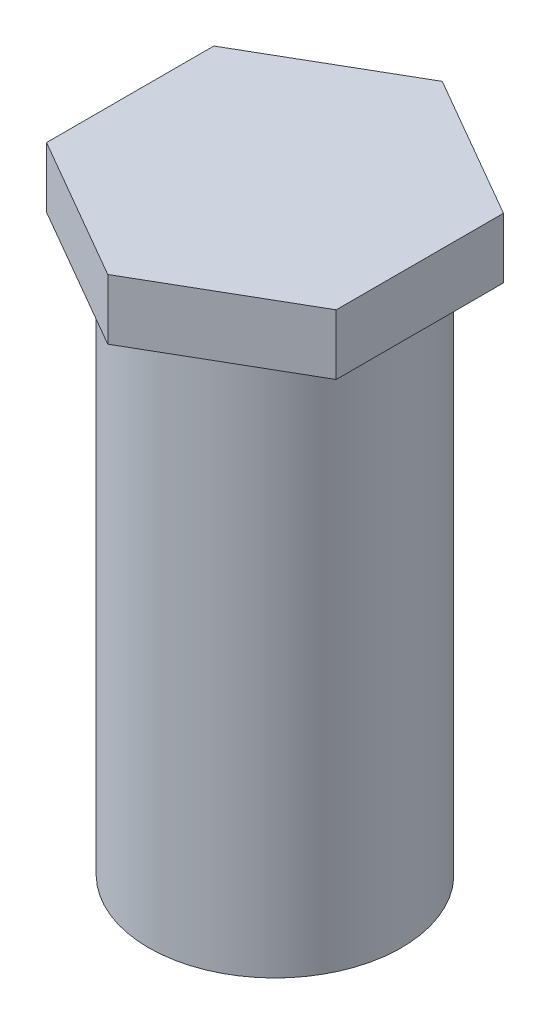
ISO-10303-21;
HEADER;
FILE_DESCRIPTION(('STEP AP214'),'2;1');
FILE_NAME('part.step','',(''),(''),'','','');
FILE_SCHEMA(('AUTOMOTIVE_DESIGN { 1 0 10303 214 1 1 1 1 }'));
ENDSEC;
DATA;
#1=APPLICATION_CONTEXT('core data for automotive mechanical design processes');
#2=APPLICATION_PROTOCOL_DEFINITION('international standard','automotive_design',2000,#1);
#3=PRODUCT_CONTEXT('',#1,'mechanical');
#4=PRODUCT('Part','Part','',(#3));
#5=PRODUCT_RELATED_PRODUCT_CATEGORY('part','',(#4));
#6=PRODUCT_DEFINITION_FORMATION('','',#4);
#7=PRODUCT_DEFINITION_CONTEXT('part definition',#1,'design');
#8=PRODUCT_DEFINITION('design','',#6,#7);
#9=PRODUCT_DEFINITION_SHAPE('','',#8);
#10=(LENGTH_UNIT() NAMED_UNIT(*) SI_UNIT(.MILLI.,.METRE.));
#11=(NAMED_UNIT(*) PLANE_ANGLE_UNIT() SI_UNIT($,.RADIAN.));
#12=(NAMED_UNIT(*) SI_UNIT($,.STERADIAN.) SOLID_ANGLE_UNIT());
#13=UNCERTAINTY_MEASURE_WITH_UNIT(LENGTH_MEASURE(1.E-05),#10,'distance_accuracy_value','');
#14=(GEOMETRIC_REPRESENTATION_CONTEXT(3) GLOBAL_UNCERTAINTY_ASSIGNED_CONTEXT((#13)) GLOBAL_UNIT_ASSIGNED_CONTEXT((#10,
#11,#12)) REPRESENTATION_CONTEXT('',''));
#15=CARTESIAN_POINT('',(0.,0.,0.));
#16=DIRECTION('',(0.,0.,1.));
#17=DIRECTION('',(1.,0.,0.));
#18=AXIS2_PLACEMENT_3D('',#15,#16,#17);
#19=CARTESIAN_POINT('',(0.,0.,0.));
#20=DIRECTION('',(0.,1.,0.));
#21=DIRECTION('',(0.,0.,1.));
#22=AXIS2_PLACEMENT_3D('',#19,#20,#21);
#23=CYLINDRICAL_SURFACE('',#22,2.095);
#24=CARTESIAN_POINT('',(0.,-10.,0.));
#25=DIRECTION('',(0.,1.,0.));
#26=DIRECTION('',(0.,0.,1.));
#27=AXIS2_PLACEMENT_3D('',#24,#25,#26);
#28=CIRCLE('',#27,2.095);
#29=CARTESIAN_POINT('',(0.,-10.,2.095));
#30=VERTEX_POINT('',#29);
#31=EDGE_CURVE('E45',#30,#30,#28,.T.);
#32=ORIENTED_EDGE('',*,*,#31,.T.);
#33=EDGE_LOOP('',(#32));
#34=FACE_BOUND('',#33,.T.);
#35=CARTESIAN_POINT('',(0.,-1.,0.));
#36=DIRECTION('',(0.,1.,0.));
#37=DIRECTION('',(0.,0.,1.));
#38=AXIS2_PLACEMENT_3D('',#35,#36,#37);
#39=CIRCLE('',#38,2.095);
#40=CARTESIAN_POINT('',(0.,-1.,2.095));
#41=VERTEX_POINT('',#40);
#42=EDGE_CURVE('E11',#41,#41,#39,.T.);
#43=ORIENTED_EDGE('',*,*,#42,.F.);
#44=EDGE_LOOP('',(#43));
#45=FACE_BOUND('',#44,.T.);
#46=ADVANCED_FACE('F36',(#34,#45),#23,.T.);
#47=CARTESIAN_POINT('',(2.095,-10.,0.));
#48=DIRECTION('',(0.,1.,0.));
#49=DIRECTION('',(0.,0.,1.));
#50=AXIS2_PLACEMENT_3D('',#47,#48,#49);
#51=PLANE('',#50);
#52=CARTESIAN_POINT('',(0.,-10.,0.));
#53=DIRECTION('',(0.,-1.,0.));
#54=DIRECTION('',(0.,0.,-1.));
#55=AXIS2_PLACEMENT_3D('',#52,#53,#54);
#56=CIRCLE('',#55,1.24999999999999);
#57=CARTESIAN_POINT('',(0.,-10.,-1.24999999999999));
#58=VERTEX_POINT('',#57);
#59=EDGE_CURVE('E195',#58,#58,#56,.T.);
#60=ORIENTED_EDGE('',*,*,#59,.F.);
#61=EDGE_LOOP('',(#60));
#62=FACE_BOUND('',#61,.T.);
#63=ORIENTED_EDGE('',*,*,#31,.F.);
#64=EDGE_LOOP('',(#63));
#65=FACE_BOUND('',#64,.T.);
#66=ADVANCED_FACE('F154',(#62,#65),#51,.F.);
#67=CARTESIAN_POINT('',(0.,-1.,0.));
#68=DIRECTION('',(0.,1.,0.));
#69=DIRECTION('',(0.,0.,1.));
#70=AXIS2_PLACEMENT_3D('',#67,#68,#69);
#71=PLANE('',#70);
#72=DIRECTION('',(0.866025403784439,0.,-0.5));
#73=VECTOR('',#72,1.);
#74=CARTESIAN_POINT('',(0.,-1.,2.7712812921102));
#75=LINE('',#74,#73);
#76=CARTESIAN_POINT('',(0.,-1.,2.7712812921102));
#77=VERTEX_POINT('',#76);
#78=CARTESIAN_POINT('',(2.4,-1.,1.3856406460551));
#79=VERTEX_POINT('',#78);
#80=EDGE_CURVE('E143',#77,#79,#75,.T.);
#81=ORIENTED_EDGE('',*,*,#80,.F.);
#82=DIRECTION('',(0.866025403784439,0.,0.5));
#83=VECTOR('',#82,1.);
#84=CARTESIAN_POINT('',(-2.4,-1.,1.3856406460551));
#85=LINE('',#84,#83);
#86=CARTESIAN_POINT('',(-2.4,-1.,1.3856406460551));
#87=VERTEX_POINT('',#86);
#88=EDGE_CURVE('E117',#87,#77,#85,.T.);
#89=ORIENTED_EDGE('',*,*,#88,.F.);
#90=DIRECTION('',(0.,0.,1.));
#91=VECTOR('',#90,1.);
#92=CARTESIAN_POINT('',(-2.4,-1.,-1.3856406460551));
#93=LINE('',#92,#91);
#94=CARTESIAN_POINT('',(-2.4,-1.,-1.3856406460551));
#95=VERTEX_POINT('',#94);
#96=EDGE_CURVE('E101',#95,#87,#93,.T.);
#97=ORIENTED_EDGE('',*,*,#96,.F.);
#98=DIRECTION('',(-0.866025403784439,0.,0.5));
#99=VECTOR('',#98,1.);
#100=CARTESIAN_POINT('',(0.,-1.,-2.77128129211021));
#101=LINE('',#100,#99);
#102=CARTESIAN_POINT('',(0.,-1.,-2.77128129211021));
#103=VERTEX_POINT('',#102);
#104=EDGE_CURVE('E115',#103,#95,#101,.T.);
#105=ORIENTED_EDGE('',*,*,#104,.F.);
#106=DIRECTION('',(-0.866025403784439,0.,-0.5));
#107=VECTOR('',#106,1.);
#108=CARTESIAN_POINT('',(2.4,-1.,-1.3856406460551));
#109=LINE('',#108,#107);
#110=CARTESIAN_POINT('',(2.4,-1.,-1.3856406460551));
#111=VERTEX_POINT('',#110);
#112=EDGE_CURVE('E120',#111,#103,#109,.T.);
#113=ORIENTED_EDGE('',*,*,#112,.F.);
#114=DIRECTION('',(0.,0.,-1.));
#115=VECTOR('',#114,1.);
#116=CARTESIAN_POINT('',(2.4,-1.,1.3856406460551));
#117=LINE('',#116,#115);
#118=EDGE_CURVE('E122',#79,#111,#117,.T.);
#119=ORIENTED_EDGE('',*,*,#118,.F.);
#120=EDGE_LOOP('',(#81,#89,#97,#105,#113,#119));
#121=FACE_BOUND('',#120,.T.);
#122=ORIENTED_EDGE('',*,*,#42,.T.);
#123=EDGE_LOOP('',(#122));
#124=FACE_BOUND('',#123,.T.);
#125=ADVANCED_FACE('F112',(#121,#124),#71,.F.);
#126=CARTESIAN_POINT('',(0.,-1.,2.7712812921102));
#127=DIRECTION('',(0.5,0.,0.866025403784439));
#128=DIRECTION('',(0.866025403784439,0.,-0.5));
#129=AXIS2_PLACEMENT_3D('',#126,#127,#128);
#130=PLANE('',#129);
#131=DIRECTION('',(0.866025403784439,0.,-0.5));
#132=VECTOR('',#131,1.);
#133=CARTESIAN_POINT('',(0.,0.,2.7712812921102));
#134=LINE('',#133,#132);
#135=CARTESIAN_POINT('',(0.,0.,2.7712812921102));
#136=VERTEX_POINT('',#135);
#137=CARTESIAN_POINT('',(2.4,0.,1.3856406460551));
#138=VERTEX_POINT('',#137);
#139=EDGE_CURVE('E127',#136,#138,#134,.T.);
#140=ORIENTED_EDGE('',*,*,#139,.F.);
#141=DIRECTION('',(0.,1.,0.));
#142=VECTOR('',#141,1.);
#143=CARTESIAN_POINT('',(0.,-1.,2.7712812921102));
#144=LINE('',#143,#142);
#145=EDGE_CURVE('E53',#77,#136,#144,.T.);
#146=ORIENTED_EDGE('',*,*,#145,.F.);
#147=ORIENTED_EDGE('',*,*,#80,.T.);
#148=DIRECTION('',(0.,1.,0.));
#149=VECTOR('',#148,1.);
#150=CARTESIAN_POINT('',(2.4,-1.,1.3856406460551));
#151=LINE('',#150,#149);
#152=EDGE_CURVE('E89',#79,#138,#151,.T.);
#153=ORIENTED_EDGE('',*,*,#152,.T.);
#154=EDGE_LOOP('',(#140,#146,#147,#153));
#155=FACE_BOUND('',#154,.T.);
#156=ADVANCED_FACE('F162',(#155),#130,.T.);
#157=CARTESIAN_POINT('',(-2.4,-1.,1.3856406460551));
#158=DIRECTION('',(-0.5,0.,0.866025403784439));
#159=DIRECTION('',(0.866025403784439,0.,0.5));
#160=AXIS2_PLACEMENT_3D('',#157,#158,#159);
#161=PLANE('',#160);
#162=DIRECTION('',(0.866025403784439,0.,0.5));
#163=VECTOR('',#162,1.);
#164=CARTESIAN_POINT('',(-2.4,0.,1.3856406460551));
#165=LINE('',#164,#163);
#166=CARTESIAN_POINT('',(-2.4,0.,1.3856406460551));
#167=VERTEX_POINT('',#166);
#168=EDGE_CURVE('E140',#167,#136,#165,.T.);
#169=ORIENTED_EDGE('',*,*,#168,.F.);
#170=DIRECTION('',(0.,1.,0.));
#171=VECTOR('',#170,1.);
#172=CARTESIAN_POINT('',(-2.4,-1.,1.3856406460551));
#173=LINE('',#172,#171);
#174=EDGE_CURVE('E77',#87,#167,#173,.T.);
#175=ORIENTED_EDGE('',*,*,#174,.F.);
#176=ORIENTED_EDGE('',*,*,#88,.T.);
#177=ORIENTED_EDGE('',*,*,#145,.T.);
#178=EDGE_LOOP('',(#169,#175,#176,#177));
#179=FACE_BOUND('',#178,.T.);
#180=ADVANCED_FACE('F168',(#179),#161,.T.);
#181=CARTESIAN_POINT('',(-2.4,-1.,-1.3856406460551));
#182=DIRECTION('',(-1.,0.,0.));
#183=DIRECTION('',(0.,0.,1.));
#184=AXIS2_PLACEMENT_3D('',#181,#182,#183);
#185=PLANE('',#184);
#186=DIRECTION('',(0.,0.,1.));
#187=VECTOR('',#186,1.);
#188=CARTESIAN_POINT('',(-2.4,0.,-1.3856406460551));
#189=LINE('',#188,#187);
#190=CARTESIAN_POINT('',(-2.4,0.,-1.3856406460551));
#191=VERTEX_POINT('',#190);
#192=EDGE_CURVE('E103',#191,#167,#189,.T.);
#193=ORIENTED_EDGE('',*,*,#192,.F.);
#194=DIRECTION('',(0.,1.,0.));
#195=VECTOR('',#194,1.);
#196=CARTESIAN_POINT('',(-2.4,-1.,-1.3856406460551));
#197=LINE('',#196,#195);
#198=EDGE_CURVE('E98',#95,#191,#197,.T.);
#199=ORIENTED_EDGE('',*,*,#198,.F.);
#200=ORIENTED_EDGE('',*,*,#96,.T.);
#201=ORIENTED_EDGE('',*,*,#174,.T.);
#202=EDGE_LOOP('',(#193,#199,#200,#201));
#203=FACE_BOUND('',#202,.T.);
#204=ADVANCED_FACE('F100',(#203),#185,.T.);
#205=CARTESIAN_POINT('',(0.,-1.,-2.77128129211021));
#206=DIRECTION('',(-0.5,0.,-0.866025403784439));
#207=DIRECTION('',(-0.866025403784439,0.,0.5));
#208=AXIS2_PLACEMENT_3D('',#205,#206,#207);
#209=PLANE('',#208);
#210=DIRECTION('',(-0.866025403784439,0.,0.5));
#211=VECTOR('',#210,1.);
#212=CARTESIAN_POINT('',(0.,0.,-2.77128129211021));
#213=LINE('',#212,#211);
#214=CARTESIAN_POINT('',(0.,0.,-2.77128129211021));
#215=VERTEX_POINT('',#214);
#216=EDGE_CURVE('E137',#215,#191,#213,.T.);
#217=ORIENTED_EDGE('',*,*,#216,.F.);
#218=DIRECTION('',(0.,1.,0.));
#219=VECTOR('',#218,1.);
#220=CARTESIAN_POINT('',(0.,-1.,-2.77128129211021));
#221=LINE('',#220,#219);
#222=EDGE_CURVE('E108',#103,#215,#221,.T.);
#223=ORIENTED_EDGE('',*,*,#222,.F.);
#224=ORIENTED_EDGE('',*,*,#104,.T.);
#225=ORIENTED_EDGE('',*,*,#198,.T.);
#226=EDGE_LOOP('',(#217,#223,#224,#225));
#227=FACE_BOUND('',#226,.T.);
#228=ADVANCED_FACE('F119',(#227),#209,.T.);
#229=CARTESIAN_POINT('',(2.4,-1.,-1.3856406460551));
#230=DIRECTION('',(0.5,0.,-0.866025403784439));
#231=DIRECTION('',(-0.866025403784439,0.,-0.5));
#232=AXIS2_PLACEMENT_3D('',#229,#230,#231);
#233=PLANE('',#232);
#234=DIRECTION('',(-0.866025403784439,0.,-0.5));
#235=VECTOR('',#234,1.);
#236=CARTESIAN_POINT('',(2.4,0.,-1.3856406460551));
#237=LINE('',#236,#235);
#238=CARTESIAN_POINT('',(2.4,0.,-1.3856406460551));
#239=VERTEX_POINT('',#238);
#240=EDGE_CURVE('E134',#239,#215,#237,.T.);
#241=ORIENTED_EDGE('',*,*,#240,.F.);
#242=DIRECTION('',(0.,1.,0.));
#243=VECTOR('',#242,1.);
#244=CARTESIAN_POINT('',(2.4,-1.,-1.3856406460551));
#245=LINE('',#244,#243);
#246=EDGE_CURVE('E147',#111,#239,#245,.T.);
#247=ORIENTED_EDGE('',*,*,#246,.F.);
#248=ORIENTED_EDGE('',*,*,#112,.T.);
#249=ORIENTED_EDGE('',*,*,#222,.T.);
#250=EDGE_LOOP('',(#241,#247,#248,#249));
#251=FACE_BOUND('',#250,.T.);
#252=ADVANCED_FACE('F172',(#251),#233,.T.);
#253=CARTESIAN_POINT('',(2.4,-1.,1.3856406460551));
#254=DIRECTION('',(1.,0.,0.));
#255=DIRECTION('',(0.,0.,-1.));
#256=AXIS2_PLACEMENT_3D('',#253,#254,#255);
#257=PLANE('',#256);
#258=DIRECTION('',(0.,0.,-1.));
#259=VECTOR('',#258,1.);
#260=CARTESIAN_POINT('',(2.4,0.,1.3856406460551));
#261=LINE('',#260,#259);
#262=EDGE_CURVE('E130',#138,#239,#261,.T.);
#263=ORIENTED_EDGE('',*,*,#262,.F.);
#264=ORIENTED_EDGE('',*,*,#152,.F.);
#265=ORIENTED_EDGE('',*,*,#118,.T.);
#266=ORIENTED_EDGE('',*,*,#246,.T.);
#267=EDGE_LOOP('',(#263,#264,#265,#266));
#268=FACE_BOUND('',#267,.T.);
#269=ADVANCED_FACE('F169',(#268),#257,.T.);
#270=CARTESIAN_POINT('',(0.,0.,0.));
#271=DIRECTION('',(0.,-1.,0.));
#272=DIRECTION('',(0.,0.,-1.));
#273=AXIS2_PLACEMENT_3D('',#270,#271,#272);
#274=PLANE('',#273);
#275=ORIENTED_EDGE('',*,*,#139,.T.);
#276=ORIENTED_EDGE('',*,*,#262,.T.);
#277=ORIENTED_EDGE('',*,*,#240,.T.);
#278=ORIENTED_EDGE('',*,*,#216,.T.);
#279=ORIENTED_EDGE('',*,*,#192,.T.);
#280=ORIENTED_EDGE('',*,*,#168,.T.);
#281=EDGE_LOOP('',(#275,#276,#277,#278,#279,#280));
#282=FACE_BOUND('',#281,.T.);
#283=ADVANCED_FACE('F38',(#282),#274,.F.);
#284=CARTESIAN_POINT('',(0.,-6.,0.));
#285=DIRECTION('',(0.,-1.,0.));
#286=DIRECTION('',(0.,0.,-1.));
#287=AXIS2_PLACEMENT_3D('',#284,#285,#286);
#288=CONICAL_SURFACE('',#287,1.25,1.02974425867665);
#289=CARTESIAN_POINT('',(0.,-5.24892422621555,0.));
#290=VERTEX_POINT('',#289);
#291=VERTEX_LOOP('',#290);
#292=FACE_BOUND('',#291,.T.);
#293=CARTESIAN_POINT('',(0.,-6.,0.));
#294=DIRECTION('',(0.,-1.,0.));
#295=DIRECTION('',(0.,0.,-1.));
#296=AXIS2_PLACEMENT_3D('',#293,#294,#295);
#297=CIRCLE('',#296,1.25);
#298=CARTESIAN_POINT('',(0.,-6.,-1.25));
#299=VERTEX_POINT('',#298);
#300=EDGE_CURVE('E131',#299,#299,#297,.T.);
#301=ORIENTED_EDGE('',*,*,#300,.T.);
#302=EDGE_LOOP('',(#301));
#303=FACE_BOUND('',#302,.T.);
#304=ADVANCED_FACE('F182',(#292,#303),#288,.F.);
#305=CARTESIAN_POINT('',(0.,-10.,0.));
#306=DIRECTION('',(0.,-1.,0.));
#307=DIRECTION('',(0.,0.,-1.));
#308=AXIS2_PLACEMENT_3D('',#305,#306,#307);
#309=CYLINDRICAL_SURFACE('',#308,1.24999999999999);
#310=ORIENTED_EDGE('',*,*,#300,.F.);
#311=EDGE_LOOP('',(#310));
#312=FACE_BOUND('',#311,.T.);
#313=ORIENTED_EDGE('',*,*,#59,.T.);
#314=EDGE_LOOP('',(#313));
#315=FACE_BOUND('',#314,.T.);
#316=ADVANCED_FACE('F185',(#312,#315),#309,.F.);
#317=CLOSED_SHELL('',(#46,#66,#125,#156,#180,#204,#228,#252,#269,#283,#304,#316));
#318=MANIFOLD_SOLID_BREP('B2',#317);
#319=ADVANCED_BREP_SHAPE_REPRESENTATION('',(#18,#318),#14);
#320=SHAPE_DEFINITION_REPRESENTATION(#9,#319);
ENDSEC;
END-ISO-10303-21;
